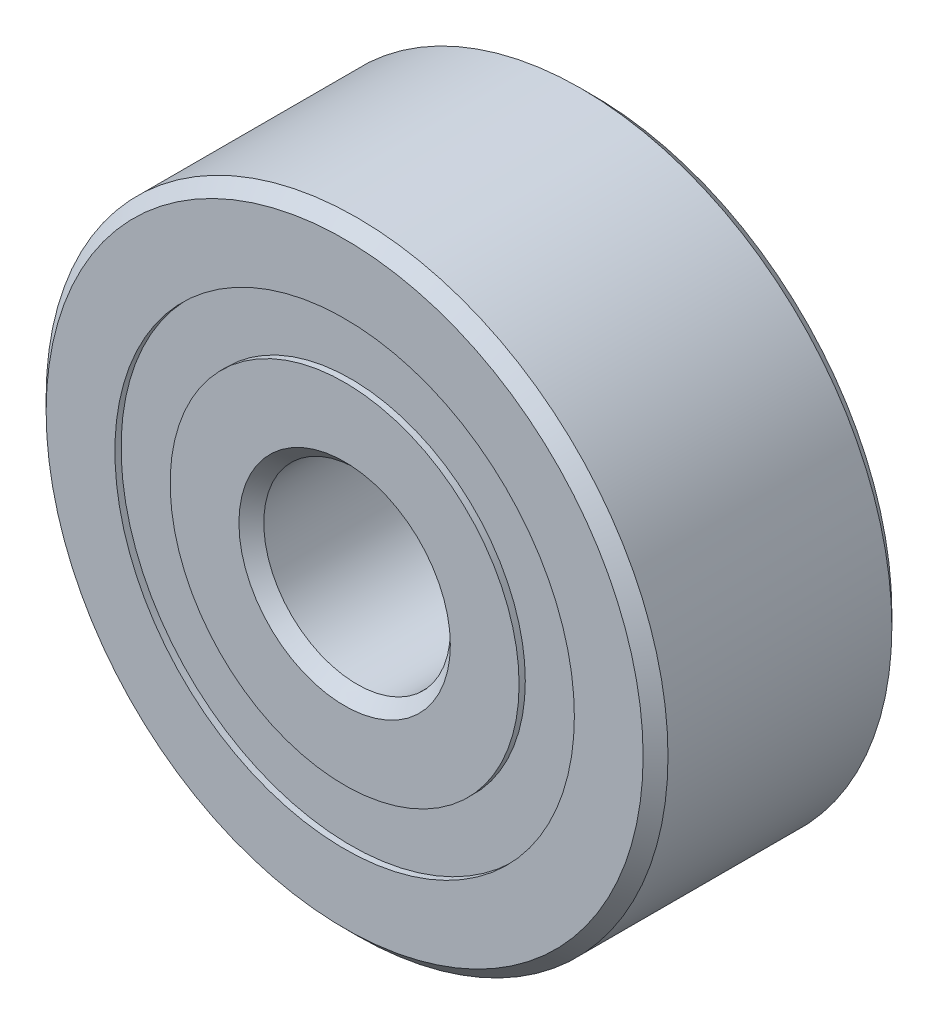
ISO-10303-21;
HEADER;
FILE_DESCRIPTION(('STEP AP214'),'2;1');
FILE_NAME('part.step','',(''),(''),'','','');
FILE_SCHEMA(('AUTOMOTIVE_DESIGN { 1 0 10303 214 1 1 1 1 }'));
ENDSEC;
DATA;
#1=APPLICATION_CONTEXT('core data for automotive mechanical design processes');
#2=APPLICATION_PROTOCOL_DEFINITION('international standard','automotive_design',2000,#1);
#3=PRODUCT_CONTEXT('',#1,'mechanical');
#4=PRODUCT('Part','Part','',(#3));
#5=PRODUCT_RELATED_PRODUCT_CATEGORY('part','',(#4));
#6=PRODUCT_DEFINITION_FORMATION('','',#4);
#7=PRODUCT_DEFINITION_CONTEXT('part definition',#1,'design');
#8=PRODUCT_DEFINITION('design','',#6,#7);
#9=PRODUCT_DEFINITION_SHAPE('','',#8);
#10=(LENGTH_UNIT() NAMED_UNIT(*) SI_UNIT(.MILLI.,.METRE.));
#11=(NAMED_UNIT(*) PLANE_ANGLE_UNIT() SI_UNIT($,.RADIAN.));
#12=(NAMED_UNIT(*) SI_UNIT($,.STERADIAN.) SOLID_ANGLE_UNIT());
#13=UNCERTAINTY_MEASURE_WITH_UNIT(LENGTH_MEASURE(1.E-05),#10,'distance_accuracy_value','');
#14=(GEOMETRIC_REPRESENTATION_CONTEXT(3) GLOBAL_UNCERTAINTY_ASSIGNED_CONTEXT((#13)) GLOBAL_UNIT_ASSIGNED_CONTEXT((#10,
#11,#12)) REPRESENTATION_CONTEXT('',''));
#15=CARTESIAN_POINT('',(0.,0.,0.));
#16=DIRECTION('',(0.,0.,1.));
#17=DIRECTION('',(1.,0.,0.));
#18=AXIS2_PLACEMENT_3D('',#15,#16,#17);
#19=CARTESIAN_POINT('',(0.,3.69444444444444,-0.993807989999908));
#20=DIRECTION('',(0.,0.,-1.));
#21=DIRECTION('',(-1.,0.,0.));
#22=AXIS2_PLACEMENT_3D('',#19,#20,#21);
#23=PLANE('',#22);
#24=CARTESIAN_POINT('',(0.,0.,-0.993807989999909));
#25=DIRECTION('',(0.,0.,1.));
#26=DIRECTION('',(1.,0.,0.));
#27=AXIS2_PLACEMENT_3D('',#24,#25,#26);
#28=CIRCLE('',#27,2.80555555555556);
#29=CARTESIAN_POINT('',(2.80555555555556,0.,-0.993807989999909));
#30=VERTEX_POINT('',#29);
#31=EDGE_CURVE('E11',#30,#30,#28,.T.);
#32=ORIENTED_EDGE('',*,*,#31,.F.);
#33=EDGE_LOOP('',(#32));
#34=FACE_BOUND('',#33,.T.);
#35=CARTESIAN_POINT('',(0.,0.,-0.993807989999908));
#36=DIRECTION('',(0.,0.,1.));
#37=DIRECTION('',(1.,0.,0.));
#38=AXIS2_PLACEMENT_3D('',#35,#36,#37);
#39=CIRCLE('',#38,3.69444444444444);
#40=CARTESIAN_POINT('',(3.69444444444444,0.,-0.993807989999908));
#41=VERTEX_POINT('',#40);
#42=EDGE_CURVE('E57',#41,#41,#39,.T.);
#43=ORIENTED_EDGE('',*,*,#42,.T.);
#44=EDGE_LOOP('',(#43));
#45=FACE_BOUND('',#44,.T.);
#46=ADVANCED_FACE('F43',(#34,#45),#23,.F.);
#47=CARTESIAN_POINT('',(0.,0.,2.));
#48=DIRECTION('',(0.,0.,1.));
#49=DIRECTION('',(1.,0.,0.));
#50=AXIS2_PLACEMENT_3D('',#47,#48,#49);
#51=CYLINDRICAL_SURFACE('',#50,2.80555555555556);
#52=CARTESIAN_POINT('',(0.,0.,-1.90000000000001));
#53=DIRECTION('',(0.,0.,1.));
#54=DIRECTION('',(1.,0.,0.));
#55=AXIS2_PLACEMENT_3D('',#52,#53,#54);
#56=CIRCLE('',#55,2.80555555555556);
#57=CARTESIAN_POINT('',(2.80555555555556,0.,-1.90000000000001));
#58=VERTEX_POINT('',#57);
#59=EDGE_CURVE('E49',#58,#58,#56,.T.);
#60=ORIENTED_EDGE('',*,*,#59,.F.);
#61=EDGE_LOOP('',(#60));
#62=FACE_BOUND('',#61,.T.);
#63=ORIENTED_EDGE('',*,*,#31,.T.);
#64=EDGE_LOOP('',(#63));
#65=FACE_BOUND('',#64,.T.);
#66=ADVANCED_FACE('F72',(#62,#65),#51,.F.);
#67=CARTESIAN_POINT('',(0.,3.69444444444444,-1.90000000000001));
#68=DIRECTION('',(0.,0.,1.));
#69=DIRECTION('',(1.,0.,0.));
#70=AXIS2_PLACEMENT_3D('',#67,#68,#69);
#71=PLANE('',#70);
#72=CARTESIAN_POINT('',(0.,0.,-1.90000000000001));
#73=DIRECTION('',(0.,0.,1.));
#74=DIRECTION('',(1.,0.,0.));
#75=AXIS2_PLACEMENT_3D('',#72,#73,#74);
#76=CIRCLE('',#75,3.69444444444444);
#77=CARTESIAN_POINT('',(3.69444444444444,0.,-1.90000000000001));
#78=VERTEX_POINT('',#77);
#79=EDGE_CURVE('E53',#78,#78,#76,.T.);
#80=ORIENTED_EDGE('',*,*,#79,.F.);
#81=EDGE_LOOP('',(#80));
#82=FACE_BOUND('',#81,.T.);
#83=ORIENTED_EDGE('',*,*,#59,.T.);
#84=EDGE_LOOP('',(#83));
#85=FACE_BOUND('',#84,.T.);
#86=ADVANCED_FACE('F67',(#82,#85),#71,.F.);
#87=CARTESIAN_POINT('',(0.,0.,2.));
#88=DIRECTION('',(0.,0.,1.));
#89=DIRECTION('',(1.,0.,0.));
#90=AXIS2_PLACEMENT_3D('',#87,#88,#89);
#91=CYLINDRICAL_SURFACE('',#90,3.69444444444444);
#92=ORIENTED_EDGE('',*,*,#42,.F.);
#93=EDGE_LOOP('',(#92));
#94=FACE_BOUND('',#93,.T.);
#95=ORIENTED_EDGE('',*,*,#79,.T.);
#96=EDGE_LOOP('',(#95));
#97=FACE_BOUND('',#96,.T.);
#98=ADVANCED_FACE('F64',(#94,#97),#91,.T.);
#99=CLOSED_SHELL('',(#46,#66,#86,#98));
#100=MANIFOLD_SOLID_BREP('B2',#99);
#101=CARTESIAN_POINT('',(0.,3.69444444444444,1.9));
#102=DIRECTION('',(0.,0.,-1.));
#103=DIRECTION('',(-1.,0.,0.));
#104=AXIS2_PLACEMENT_3D('',#101,#102,#103);
#105=PLANE('',#104);
#106=CARTESIAN_POINT('',(0.,0.,1.9));
#107=DIRECTION('',(0.,0.,1.));
#108=DIRECTION('',(1.,0.,0.));
#109=AXIS2_PLACEMENT_3D('',#106,#107,#108);
#110=CIRCLE('',#109,2.80555555555556);
#111=CARTESIAN_POINT('',(2.80555555555556,0.,1.9));
#112=VERTEX_POINT('',#111);
#113=EDGE_CURVE('E42',#112,#112,#110,.T.);
#114=ORIENTED_EDGE('',*,*,#113,.F.);
#115=EDGE_LOOP('',(#114));
#116=FACE_BOUND('',#115,.T.);
#117=CARTESIAN_POINT('',(0.,0.,1.9));
#118=DIRECTION('',(0.,0.,1.));
#119=DIRECTION('',(1.,0.,0.));
#120=AXIS2_PLACEMENT_3D('',#117,#118,#119);
#121=CIRCLE('',#120,3.69444444444444);
#122=CARTESIAN_POINT('',(3.69444444444444,0.,1.9));
#123=VERTEX_POINT('',#122);
#124=EDGE_CURVE('E124',#123,#123,#121,.T.);
#125=ORIENTED_EDGE('',*,*,#124,.T.);
#126=EDGE_LOOP('',(#125));
#127=FACE_BOUND('',#126,.T.);
#128=ADVANCED_FACE('F110',(#116,#127),#105,.F.);
#129=CARTESIAN_POINT('',(0.,0.,2.));
#130=DIRECTION('',(0.,0.,1.));
#131=DIRECTION('',(1.,0.,0.));
#132=AXIS2_PLACEMENT_3D('',#129,#130,#131);
#133=CYLINDRICAL_SURFACE('',#132,2.80555555555556);
#134=CARTESIAN_POINT('',(0.,0.,0.993807989999899));
#135=DIRECTION('',(0.,0.,1.));
#136=DIRECTION('',(1.,0.,0.));
#137=AXIS2_PLACEMENT_3D('',#134,#135,#136);
#138=CIRCLE('',#137,2.80555555555556);
#139=CARTESIAN_POINT('',(2.80555555555556,0.,0.993807989999899));
#140=VERTEX_POINT('',#139);
#141=EDGE_CURVE('E116',#140,#140,#138,.T.);
#142=ORIENTED_EDGE('',*,*,#141,.F.);
#143=EDGE_LOOP('',(#142));
#144=FACE_BOUND('',#143,.T.);
#145=ORIENTED_EDGE('',*,*,#113,.T.);
#146=EDGE_LOOP('',(#145));
#147=FACE_BOUND('',#146,.T.);
#148=ADVANCED_FACE('F139',(#144,#147),#133,.F.);
#149=CARTESIAN_POINT('',(0.,3.69444444444444,0.993807989999899));
#150=DIRECTION('',(0.,0.,1.));
#151=DIRECTION('',(1.,0.,0.));
#152=AXIS2_PLACEMENT_3D('',#149,#150,#151);
#153=PLANE('',#152);
#154=CARTESIAN_POINT('',(0.,0.,0.993807989999899));
#155=DIRECTION('',(0.,0.,1.));
#156=DIRECTION('',(1.,0.,0.));
#157=AXIS2_PLACEMENT_3D('',#154,#155,#156);
#158=CIRCLE('',#157,3.69444444444444);
#159=CARTESIAN_POINT('',(3.69444444444444,0.,0.993807989999899));
#160=VERTEX_POINT('',#159);
#161=EDGE_CURVE('E120',#160,#160,#158,.T.);
#162=ORIENTED_EDGE('',*,*,#161,.F.);
#163=EDGE_LOOP('',(#162));
#164=FACE_BOUND('',#163,.T.);
#165=ORIENTED_EDGE('',*,*,#141,.T.);
#166=EDGE_LOOP('',(#165));
#167=FACE_BOUND('',#166,.T.);
#168=ADVANCED_FACE('F134',(#164,#167),#153,.F.);
#169=CARTESIAN_POINT('',(0.,0.,2.));
#170=DIRECTION('',(0.,0.,1.));
#171=DIRECTION('',(1.,0.,0.));
#172=AXIS2_PLACEMENT_3D('',#169,#170,#171);
#173=CYLINDRICAL_SURFACE('',#172,3.69444444444444);
#174=ORIENTED_EDGE('',*,*,#124,.F.);
#175=EDGE_LOOP('',(#174));
#176=FACE_BOUND('',#175,.T.);
#177=ORIENTED_EDGE('',*,*,#161,.T.);
#178=EDGE_LOOP('',(#177));
#179=FACE_BOUND('',#178,.T.);
#180=ADVANCED_FACE('F131',(#176,#179),#173,.T.);
#181=CLOSED_SHELL('',(#128,#148,#168,#180));
#182=MANIFOLD_SOLID_BREP('B6',#181);
#183=CARTESIAN_POINT('',(-2.08905973148122,2.4896444401367,0.));
#184=DIRECTION('',(0.,0.,1.));
#185=DIRECTION('',(-0.64278760968653,0.766044443118986,0.));
#186=AXIS2_PLACEMENT_3D('',#183,#184,#185);
#187=SPHERICAL_SURFACE('',#186,0.993807989999899);
#188=CARTESIAN_POINT('',(-2.08905973148122,2.4896444401367,0.993807989999896));
#189=VERTEX_POINT('',#188);
#190=VERTEX_LOOP('',#189);
#191=FACE_BOUND('',#190,.T.);
#192=ADVANCED_FACE('F177',(#191),#187,.T.);
#193=CLOSED_SHELL('',(#192));
#194=MANIFOLD_SOLID_BREP('B37',#193);
#195=CARTESIAN_POINT('',(-3.20062519728967,0.564356577417556,0.));
#196=DIRECTION('',(0.,0.,1.));
#197=DIRECTION('',(-0.984807753012206,0.17364817766694,0.));
#198=AXIS2_PLACEMENT_3D('',#195,#196,#197);
#199=SPHERICAL_SURFACE('',#198,0.993807989999899);
#200=CARTESIAN_POINT('',(-3.20062519728967,0.564356577417556,0.993807989999896));
#201=VERTEX_POINT('',#200);
#202=VERTEX_LOOP('',#201);
#203=FACE_BOUND('',#202,.T.);
#204=ADVANCED_FACE('F210',(#203),#199,.T.);
#205=CLOSED_SHELL('',(#204));
#206=MANIFOLD_SOLID_BREP('B106',#205);
#207=CARTESIAN_POINT('',(-2.81458256229944,-1.62499999999997,0.));
#208=DIRECTION('',(0.,0.,1.));
#209=DIRECTION('',(-0.866025403784443,-0.499999999999992,0.));
#210=AXIS2_PLACEMENT_3D('',#207,#208,#209);
#211=SPHERICAL_SURFACE('',#210,0.993807989999899);
#212=CARTESIAN_POINT('',(-2.81458256229944,-1.62499999999997,0.993807989999896));
#213=VERTEX_POINT('',#212);
#214=VERTEX_LOOP('',#213);
#215=FACE_BOUND('',#214,.T.);
#216=ADVANCED_FACE('F243',(#215),#211,.T.);
#217=CLOSED_SHELL('',(#216));
#218=MANIFOLD_SOLID_BREP('B173',#217);
#219=CARTESIAN_POINT('',(-1.11156546580845,-3.05400101755419,0.));
#220=DIRECTION('',(0.,0.,1.));
#221=DIRECTION('',(-0.342020143325676,-0.939692620785906,0.));
#222=AXIS2_PLACEMENT_3D('',#219,#220,#221);
#223=SPHERICAL_SURFACE('',#222,0.993807989999899);
#224=CARTESIAN_POINT('',(-1.11156546580845,-3.05400101755419,0.993807989999896));
#225=VERTEX_POINT('',#224);
#226=VERTEX_LOOP('',#225);
#227=FACE_BOUND('',#226,.T.);
#228=ADVANCED_FACE('F276',(#227),#223,.T.);
#229=CLOSED_SHELL('',(#228));
#230=MANIFOLD_SOLID_BREP('B206',#229);
#231=CARTESIAN_POINT('',(1.11156546580841,-3.05400101755421,0.));
#232=DIRECTION('',(0.,0.,1.));
#233=DIRECTION('',(0.342020143325663,-0.939692620785911,0.));
#234=AXIS2_PLACEMENT_3D('',#231,#232,#233);
#235=SPHERICAL_SURFACE('',#234,0.993807989999899);
#236=CARTESIAN_POINT('',(1.11156546580841,-3.05400101755421,0.993807989999896));
#237=VERTEX_POINT('',#236);
#238=VERTEX_LOOP('',#237);
#239=FACE_BOUND('',#238,.T.);
#240=ADVANCED_FACE('F309',(#239),#235,.T.);
#241=CLOSED_SHELL('',(#240));
#242=MANIFOLD_SOLID_BREP('B239',#241);
#243=CARTESIAN_POINT('',(2.81458256229942,-1.62500000000001,0.));
#244=DIRECTION('',(0.,0.,1.));
#245=DIRECTION('',(0.866025403784436,-0.500000000000004,0.));
#246=AXIS2_PLACEMENT_3D('',#243,#244,#245);
#247=SPHERICAL_SURFACE('',#246,0.993807989999899);
#248=CARTESIAN_POINT('',(2.81458256229942,-1.62500000000001,0.993807989999896));
#249=VERTEX_POINT('',#248);
#250=VERTEX_LOOP('',#249);
#251=FACE_BOUND('',#250,.T.);
#252=ADVANCED_FACE('F342',(#251),#247,.T.);
#253=CLOSED_SHELL('',(#252));
#254=MANIFOLD_SOLID_BREP('B272',#253);
#255=CARTESIAN_POINT('',(3.20062519728968,0.564356577417514,0.));
#256=DIRECTION('',(0.,0.,1.));
#257=DIRECTION('',(0.984807753012209,0.173648177666927,0.));
#258=AXIS2_PLACEMENT_3D('',#255,#256,#257);
#259=SPHERICAL_SURFACE('',#258,0.993807989999899);
#260=CARTESIAN_POINT('',(3.20062519728968,0.564356577417514,0.993807989999896));
#261=VERTEX_POINT('',#260);
#262=VERTEX_LOOP('',#261);
#263=FACE_BOUND('',#262,.T.);
#264=ADVANCED_FACE('F375',(#263),#259,.T.);
#265=CLOSED_SHELL('',(#264));
#266=MANIFOLD_SOLID_BREP('B305',#265);
#267=CARTESIAN_POINT('',(2.08905973148126,2.48964444013668,0.));
#268=DIRECTION('',(0.,0.,1.));
#269=DIRECTION('',(0.642787609686541,0.766044443118977,0.));
#270=AXIS2_PLACEMENT_3D('',#267,#268,#269);
#271=SPHERICAL_SURFACE('',#270,0.993807989999899);
#272=CARTESIAN_POINT('',(2.08905973148126,2.48964444013668,0.993807989999896));
#273=VERTEX_POINT('',#272);
#274=VERTEX_LOOP('',#273);
#275=FACE_BOUND('',#274,.T.);
#276=ADVANCED_FACE('F408',(#275),#271,.T.);
#277=CLOSED_SHELL('',(#276));
#278=MANIFOLD_SOLID_BREP('B338',#277);
#279=CARTESIAN_POINT('',(0.,3.25,0.));
#280=DIRECTION('',(0.,0.,1.));
#281=DIRECTION('',(0.,1.,0.));
#282=AXIS2_PLACEMENT_3D('',#279,#280,#281);
#283=SPHERICAL_SURFACE('',#282,0.993807989999899);
#284=CARTESIAN_POINT('',(0.,3.25,0.993807989999896));
#285=VERTEX_POINT('',#284);
#286=VERTEX_LOOP('',#285);
#287=FACE_BOUND('',#286,.T.);
#288=ADVANCED_FACE('F443',(#287),#283,.T.);
#289=CLOSED_SHELL('',(#288));
#290=MANIFOLD_SOLID_BREP('B371',#289);
#291=CARTESIAN_POINT('',(0.,2.80555555555556,2.));
#292=DIRECTION('',(0.,0.,-1.));
#293=DIRECTION('',(-1.,0.,0.));
#294=AXIS2_PLACEMENT_3D('',#291,#292,#293);
#295=PLANE('',#294);
#296=CARTESIAN_POINT('',(0.,0.,2.));
#297=DIRECTION('',(0.,0.,1.));
#298=DIRECTION('',(1.,0.,0.));
#299=AXIS2_PLACEMENT_3D('',#296,#297,#298);
#300=CIRCLE('',#299,1.7);
#301=CARTESIAN_POINT('',(1.7,0.,2.));
#302=VERTEX_POINT('',#301);
#303=EDGE_CURVE('E442',#302,#302,#300,.T.);
#304=ORIENTED_EDGE('',*,*,#303,.F.);
#305=EDGE_LOOP('',(#304));
#306=FACE_BOUND('',#305,.T.);
#307=CARTESIAN_POINT('',(0.,0.,2.));
#308=DIRECTION('',(0.,0.,1.));
#309=DIRECTION('',(1.,0.,0.));
#310=AXIS2_PLACEMENT_3D('',#307,#308,#309);
#311=CIRCLE('',#310,2.80555555555556);
#312=CARTESIAN_POINT('',(2.80555555555556,0.,2.));
#313=VERTEX_POINT('',#312);
#314=EDGE_CURVE('E490',#313,#313,#311,.T.);
#315=ORIENTED_EDGE('',*,*,#314,.T.);
#316=EDGE_LOOP('',(#315));
#317=FACE_BOUND('',#316,.T.);
#318=ADVANCED_FACE('F462',(#306,#317),#295,.F.);
#319=CARTESIAN_POINT('',(0.,0.,2.));
#320=DIRECTION('',(0.,0.,1.));
#321=DIRECTION('',(1.,0.,0.));
#322=AXIS2_PLACEMENT_3D('',#319,#320,#321);
#323=CONICAL_SURFACE('',#322,1.7,0.785398163397435);
#324=CARTESIAN_POINT('',(0.,0.,1.8));
#325=DIRECTION('',(0.,0.,1.));
#326=DIRECTION('',(1.,0.,0.));
#327=AXIS2_PLACEMENT_3D('',#324,#325,#326);
#328=CIRCLE('',#327,1.5);
#329=CARTESIAN_POINT('',(1.5,0.,1.8));
#330=VERTEX_POINT('',#329);
#331=EDGE_CURVE('E468',#330,#330,#328,.T.);
#332=ORIENTED_EDGE('',*,*,#331,.F.);
#333=EDGE_LOOP('',(#332));
#334=FACE_BOUND('',#333,.T.);
#335=ORIENTED_EDGE('',*,*,#303,.T.);
#336=EDGE_LOOP('',(#335));
#337=FACE_BOUND('',#336,.T.);
#338=ADVANCED_FACE('F527',(#334,#337),#323,.F.);
#339=CARTESIAN_POINT('',(0.,0.,2.));
#340=DIRECTION('',(0.,0.,1.));
#341=DIRECTION('',(1.,0.,0.));
#342=AXIS2_PLACEMENT_3D('',#339,#340,#341);
#343=CYLINDRICAL_SURFACE('',#342,1.5);
#344=CARTESIAN_POINT('',(0.,0.,-1.8));
#345=DIRECTION('',(0.,0.,1.));
#346=DIRECTION('',(1.,0.,0.));
#347=AXIS2_PLACEMENT_3D('',#344,#345,#346);
#348=CIRCLE('',#347,1.5);
#349=CARTESIAN_POINT('',(1.5,0.,-1.8));
#350=VERTEX_POINT('',#349);
#351=EDGE_CURVE('E472',#350,#350,#348,.T.);
#352=ORIENTED_EDGE('',*,*,#351,.F.);
#353=EDGE_LOOP('',(#352));
#354=FACE_BOUND('',#353,.T.);
#355=ORIENTED_EDGE('',*,*,#331,.T.);
#356=EDGE_LOOP('',(#355));
#357=FACE_BOUND('',#356,.T.);
#358=ADVANCED_FACE('F522',(#354,#357),#343,.F.);
#359=CARTESIAN_POINT('',(0.,0.,-1.8));
#360=DIRECTION('',(0.,0.,-1.));
#361=DIRECTION('',(-1.,0.,0.));
#362=AXIS2_PLACEMENT_3D('',#359,#360,#361);
#363=CONICAL_SURFACE('',#362,1.5,0.785398163397435);
#364=CARTESIAN_POINT('',(0.,0.,-2.));
#365=DIRECTION('',(0.,0.,1.));
#366=DIRECTION('',(1.,0.,0.));
#367=AXIS2_PLACEMENT_3D('',#364,#365,#366);
#368=CIRCLE('',#367,1.7);
#369=CARTESIAN_POINT('',(1.7,0.,-2.));
#370=VERTEX_POINT('',#369);
#371=EDGE_CURVE('E476',#370,#370,#368,.T.);
#372=ORIENTED_EDGE('',*,*,#371,.F.);
#373=EDGE_LOOP('',(#372));
#374=FACE_BOUND('',#373,.T.);
#375=ORIENTED_EDGE('',*,*,#351,.T.);
#376=EDGE_LOOP('',(#375));
#377=FACE_BOUND('',#376,.T.);
#378=ADVANCED_FACE('F516',(#374,#377),#363,.F.);
#379=CARTESIAN_POINT('',(0.,2.80555555555556,-2.));
#380=DIRECTION('',(0.,0.,1.));
#381=DIRECTION('',(1.,0.,0.));
#382=AXIS2_PLACEMENT_3D('',#379,#380,#381);
#383=PLANE('',#382);
#384=CARTESIAN_POINT('',(0.,0.,-2.00000000000001));
#385=DIRECTION('',(0.,0.,1.));
#386=DIRECTION('',(1.,0.,0.));
#387=AXIS2_PLACEMENT_3D('',#384,#385,#386);
#388=CIRCLE('',#387,2.80555555555556);
#389=CARTESIAN_POINT('',(2.80555555555556,0.,-2.00000000000001));
#390=VERTEX_POINT('',#389);
#391=EDGE_CURVE('E481',#390,#390,#388,.T.);
#392=ORIENTED_EDGE('',*,*,#391,.F.);
#393=EDGE_LOOP('',(#392));
#394=FACE_BOUND('',#393,.T.);
#395=ORIENTED_EDGE('',*,*,#371,.T.);
#396=EDGE_LOOP('',(#395));
#397=FACE_BOUND('',#396,.T.);
#398=ADVANCED_FACE('F510',(#394,#397),#383,.F.);
#399=CARTESIAN_POINT('',(0.,0.,2.));
#400=DIRECTION('',(0.,0.,1.));
#401=DIRECTION('',(1.,0.,0.));
#402=AXIS2_PLACEMENT_3D('',#399,#400,#401);
#403=CYLINDRICAL_SURFACE('',#402,2.80555555555556);
#404=CARTESIAN_POINT('',(0.,0.,-0.88888888888889));
#405=DIRECTION('',(0.,0.,1.));
#406=DIRECTION('',(1.,0.,0.));
#407=AXIS2_PLACEMENT_3D('',#404,#405,#406);
#408=CIRCLE('',#407,2.80555555555556);
#409=CARTESIAN_POINT('',(2.80555555555556,0.,-0.88888888888889));
#410=VERTEX_POINT('',#409);
#411=EDGE_CURVE('E484',#410,#410,#408,.T.);
#412=ORIENTED_EDGE('',*,*,#411,.F.);
#413=EDGE_LOOP('',(#412));
#414=FACE_BOUND('',#413,.T.);
#415=ORIENTED_EDGE('',*,*,#391,.T.);
#416=EDGE_LOOP('',(#415));
#417=FACE_BOUND('',#416,.T.);
#418=ADVANCED_FACE('F504',(#414,#417),#403,.T.);
#419=CARTESIAN_POINT('',(0.,0.,0.));
#420=DIRECTION('',(0.,0.,1.));
#421=DIRECTION('',(1.,0.,0.));
#422=AXIS2_PLACEMENT_3D('',#419,#420,#421);
#423=TOROIDAL_SURFACE('',#422,3.25,0.993807989999902);
#424=CARTESIAN_POINT('',(0.,0.,0.888888888888885));
#425=DIRECTION('',(0.,0.,1.));
#426=DIRECTION('',(1.,0.,0.));
#427=AXIS2_PLACEMENT_3D('',#424,#425,#426);
#428=CIRCLE('',#427,2.80555555555556);
#429=CARTESIAN_POINT('',(2.80555555555556,0.,0.888888888888885));
#430=VERTEX_POINT('',#429);
#431=EDGE_CURVE('E487',#430,#430,#428,.T.);
#432=ORIENTED_EDGE('',*,*,#431,.F.);
#433=EDGE_LOOP('',(#432));
#434=FACE_BOUND('',#433,.T.);
#435=ORIENTED_EDGE('',*,*,#411,.T.);
#436=EDGE_LOOP('',(#435));
#437=FACE_BOUND('',#436,.T.);
#438=ADVANCED_FACE('F498',(#434,#437),#423,.F.);
#439=CARTESIAN_POINT('',(0.,0.,2.));
#440=DIRECTION('',(0.,0.,1.));
#441=DIRECTION('',(1.,0.,0.));
#442=AXIS2_PLACEMENT_3D('',#439,#440,#441);
#443=CYLINDRICAL_SURFACE('',#442,2.80555555555556);
#444=ORIENTED_EDGE('',*,*,#314,.F.);
#445=EDGE_LOOP('',(#444));
#446=FACE_BOUND('',#445,.T.);
#447=ORIENTED_EDGE('',*,*,#431,.T.);
#448=EDGE_LOOP('',(#447));
#449=FACE_BOUND('',#448,.T.);
#450=ADVANCED_FACE('F495',(#446,#449),#443,.T.);
#451=CLOSED_SHELL('',(#318,#338,#358,#378,#398,#418,#438,#450));
#452=MANIFOLD_SOLID_BREP('B404',#451);
#453=CARTESIAN_POINT('',(0.,0.,1.8));
#454=DIRECTION('',(0.,0.,-1.));
#455=DIRECTION('',(-1.,0.,0.));
#456=AXIS2_PLACEMENT_3D('',#453,#454,#455);
#457=CONICAL_SURFACE('',#456,5.,0.785398163397438);
#458=CARTESIAN_POINT('',(0.,0.,2.));
#459=DIRECTION('',(0.,0.,1.));
#460=DIRECTION('',(1.,0.,0.));
#461=AXIS2_PLACEMENT_3D('',#458,#459,#460);
#462=CIRCLE('',#461,4.80000000000001);
#463=CARTESIAN_POINT('',(4.80000000000001,0.,2.));
#464=VERTEX_POINT('',#463);
#465=EDGE_CURVE('E611',#464,#464,#462,.T.);
#466=ORIENTED_EDGE('',*,*,#465,.F.);
#467=EDGE_LOOP('',(#466));
#468=FACE_BOUND('',#467,.T.);
#469=CARTESIAN_POINT('',(0.,0.,1.8));
#470=DIRECTION('',(0.,0.,1.));
#471=DIRECTION('',(1.,0.,0.));
#472=AXIS2_PLACEMENT_3D('',#469,#470,#471);
#473=CIRCLE('',#472,5.);
#474=CARTESIAN_POINT('',(5.,0.,1.8));
#475=VERTEX_POINT('',#474);
#476=EDGE_CURVE('E461',#475,#475,#473,.T.);
#477=ORIENTED_EDGE('',*,*,#476,.T.);
#478=EDGE_LOOP('',(#477));
#479=FACE_BOUND('',#478,.T.);
#480=ADVANCED_FACE('F583',(#468,#479),#457,.T.);
#481=CARTESIAN_POINT('',(0.,0.,2.));
#482=DIRECTION('',(0.,0.,1.));
#483=DIRECTION('',(1.,0.,0.));
#484=AXIS2_PLACEMENT_3D('',#481,#482,#483);
#485=CYLINDRICAL_SURFACE('',#484,5.);
#486=ORIENTED_EDGE('',*,*,#476,.F.);
#487=EDGE_LOOP('',(#486));
#488=FACE_BOUND('',#487,.T.);
#489=CARTESIAN_POINT('',(0.,0.,-1.80000000000001));
#490=DIRECTION('',(0.,0.,1.));
#491=DIRECTION('',(1.,0.,0.));
#492=AXIS2_PLACEMENT_3D('',#489,#490,#491);
#493=CIRCLE('',#492,5.);
#494=CARTESIAN_POINT('',(5.,0.,-1.80000000000001));
#495=VERTEX_POINT('',#494);
#496=EDGE_CURVE('E589',#495,#495,#493,.T.);
#497=ORIENTED_EDGE('',*,*,#496,.T.);
#498=EDGE_LOOP('',(#497));
#499=FACE_BOUND('',#498,.T.);
#500=ADVANCED_FACE('F618',(#488,#499),#485,.T.);
#501=CARTESIAN_POINT('',(0.,0.,-2.00000000000001));
#502=DIRECTION('',(0.,0.,1.));
#503=DIRECTION('',(1.,0.,0.));
#504=AXIS2_PLACEMENT_3D('',#501,#502,#503);
#505=CONICAL_SURFACE('',#504,4.80000000000001,0.785398163397438);
#506=ORIENTED_EDGE('',*,*,#496,.F.);
#507=EDGE_LOOP('',(#506));
#508=FACE_BOUND('',#507,.T.);
#509=CARTESIAN_POINT('',(0.,0.,-2.00000000000001));
#510=DIRECTION('',(0.,0.,1.));
#511=DIRECTION('',(1.,0.,0.));
#512=AXIS2_PLACEMENT_3D('',#509,#510,#511);
#513=CIRCLE('',#512,4.80000000000001);
#514=CARTESIAN_POINT('',(4.80000000000001,0.,-2.00000000000001));
#515=VERTEX_POINT('',#514);
#516=EDGE_CURVE('E593',#515,#515,#513,.T.);
#517=ORIENTED_EDGE('',*,*,#516,.T.);
#518=EDGE_LOOP('',(#517));
#519=FACE_BOUND('',#518,.T.);
#520=ADVANCED_FACE('F622',(#508,#519),#505,.T.);
#521=CARTESIAN_POINT('',(0.,4.80000000000001,-2.00000000000001));
#522=DIRECTION('',(0.,0.,1.));
#523=DIRECTION('',(1.,0.,0.));
#524=AXIS2_PLACEMENT_3D('',#521,#522,#523);
#525=PLANE('',#524);
#526=ORIENTED_EDGE('',*,*,#516,.F.);
#527=EDGE_LOOP('',(#526));
#528=FACE_BOUND('',#527,.T.);
#529=CARTESIAN_POINT('',(0.,0.,-2.00000000000001));
#530=DIRECTION('',(0.,0.,1.));
#531=DIRECTION('',(1.,0.,0.));
#532=AXIS2_PLACEMENT_3D('',#529,#530,#531);
#533=CIRCLE('',#532,3.69444444444444);
#534=CARTESIAN_POINT('',(3.69444444444444,0.,-2.00000000000001));
#535=VERTEX_POINT('',#534);
#536=EDGE_CURVE('E597',#535,#535,#533,.T.);
#537=ORIENTED_EDGE('',*,*,#536,.T.);
#538=EDGE_LOOP('',(#537));
#539=FACE_BOUND('',#538,.T.);
#540=ADVANCED_FACE('F627',(#528,#539),#525,.F.);
#541=CARTESIAN_POINT('',(0.,0.,2.));
#542=DIRECTION('',(0.,0.,1.));
#543=DIRECTION('',(1.,0.,0.));
#544=AXIS2_PLACEMENT_3D('',#541,#542,#543);
#545=CYLINDRICAL_SURFACE('',#544,3.69444444444444);
#546=ORIENTED_EDGE('',*,*,#536,.F.);
#547=EDGE_LOOP('',(#546));
#548=FACE_BOUND('',#547,.T.);
#549=CARTESIAN_POINT('',(0.,0.,-0.888888888888893));
#550=DIRECTION('',(0.,0.,1.));
#551=DIRECTION('',(1.,0.,0.));
#552=AXIS2_PLACEMENT_3D('',#549,#550,#551);
#553=CIRCLE('',#552,3.69444444444444);
#554=CARTESIAN_POINT('',(3.69444444444444,0.,-0.888888888888893));
#555=VERTEX_POINT('',#554);
#556=EDGE_CURVE('E602',#555,#555,#553,.T.);
#557=ORIENTED_EDGE('',*,*,#556,.T.);
#558=EDGE_LOOP('',(#557));
#559=FACE_BOUND('',#558,.T.);
#560=ADVANCED_FACE('F633',(#548,#559),#545,.F.);
#561=CARTESIAN_POINT('',(0.,0.,0.));
#562=DIRECTION('',(0.,0.,1.));
#563=DIRECTION('',(1.,0.,0.));
#564=AXIS2_PLACEMENT_3D('',#561,#562,#563);
#565=TOROIDAL_SURFACE('',#564,3.25,0.993807989999903);
#566=ORIENTED_EDGE('',*,*,#556,.F.);
#567=EDGE_LOOP('',(#566));
#568=FACE_BOUND('',#567,.T.);
#569=CARTESIAN_POINT('',(0.,0.,0.888888888888884));
#570=DIRECTION('',(0.,0.,1.));
#571=DIRECTION('',(1.,0.,0.));
#572=AXIS2_PLACEMENT_3D('',#569,#570,#571);
#573=CIRCLE('',#572,3.69444444444444);
#574=CARTESIAN_POINT('',(3.69444444444444,0.,0.888888888888884));
#575=VERTEX_POINT('',#574);
#576=EDGE_CURVE('E605',#575,#575,#573,.T.);
#577=ORIENTED_EDGE('',*,*,#576,.T.);
#578=EDGE_LOOP('',(#577));
#579=FACE_BOUND('',#578,.T.);
#580=ADVANCED_FACE('F637',(#568,#579),#565,.F.);
#581=CARTESIAN_POINT('',(0.,0.,2.));
#582=DIRECTION('',(0.,0.,1.));
#583=DIRECTION('',(1.,0.,0.));
#584=AXIS2_PLACEMENT_3D('',#581,#582,#583);
#585=CYLINDRICAL_SURFACE('',#584,3.69444444444444);
#586=ORIENTED_EDGE('',*,*,#576,.F.);
#587=EDGE_LOOP('',(#586));
#588=FACE_BOUND('',#587,.T.);
#589=CARTESIAN_POINT('',(0.,0.,2.));
#590=DIRECTION('',(0.,0.,1.));
#591=DIRECTION('',(1.,0.,0.));
#592=AXIS2_PLACEMENT_3D('',#589,#590,#591);
#593=CIRCLE('',#592,3.69444444444444);
#594=CARTESIAN_POINT('',(3.69444444444444,0.,2.));
#595=VERTEX_POINT('',#594);
#596=EDGE_CURVE('E608',#595,#595,#593,.T.);
#597=ORIENTED_EDGE('',*,*,#596,.T.);
#598=EDGE_LOOP('',(#597));
#599=FACE_BOUND('',#598,.T.);
#600=ADVANCED_FACE('F641',(#588,#599),#585,.F.);
#601=CARTESIAN_POINT('',(0.,4.80000000000001,2.));
#602=DIRECTION('',(0.,0.,-1.));
#603=DIRECTION('',(-1.,0.,0.));
#604=AXIS2_PLACEMENT_3D('',#601,#602,#603);
#605=PLANE('',#604);
#606=ORIENTED_EDGE('',*,*,#596,.F.);
#607=EDGE_LOOP('',(#606));
#608=FACE_BOUND('',#607,.T.);
#609=ORIENTED_EDGE('',*,*,#465,.T.);
#610=EDGE_LOOP('',(#609));
#611=FACE_BOUND('',#610,.T.);
#612=ADVANCED_FACE('F615',(#608,#611),#605,.F.);
#613=CLOSED_SHELL('',(#480,#500,#520,#540,#560,#580,#600,#612));
#614=MANIFOLD_SOLID_BREP('B437',#613);
#615=ADVANCED_BREP_SHAPE_REPRESENTATION('',(#18,#100,#182,#194,#206,#218,#230,#242,#254,#266,
#278,#290,#452,#614),#14);
#616=SHAPE_DEFINITION_REPRESENTATION(#9,#615);
ENDSEC;
END-ISO-10303-21;
